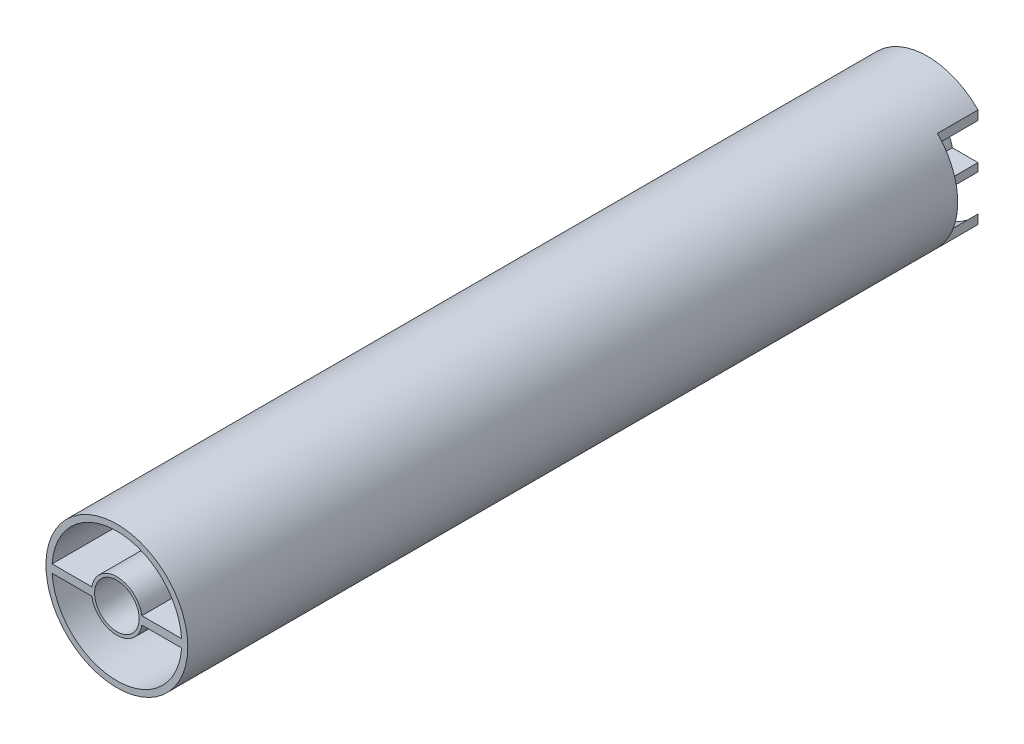
ISO-10303-21;
HEADER;
FILE_DESCRIPTION(('STEP AP214'),'2;1');
FILE_NAME('part.step','',(''),(''),'','','');
FILE_SCHEMA(('AUTOMOTIVE_DESIGN { 1 0 10303 214 1 1 1 1 }'));
ENDSEC;
DATA;
#1=APPLICATION_CONTEXT('core data for automotive mechanical design processes');
#2=APPLICATION_PROTOCOL_DEFINITION('international standard','automotive_design',2000,#1);
#3=PRODUCT_CONTEXT('',#1,'mechanical');
#4=PRODUCT('Part','Part','',(#3));
#5=PRODUCT_RELATED_PRODUCT_CATEGORY('part','',(#4));
#6=PRODUCT_DEFINITION_FORMATION('','',#4);
#7=PRODUCT_DEFINITION_CONTEXT('part definition',#1,'design');
#8=PRODUCT_DEFINITION('design','',#6,#7);
#9=PRODUCT_DEFINITION_SHAPE('','',#8);
#10=(LENGTH_UNIT() NAMED_UNIT(*) SI_UNIT(.MILLI.,.METRE.));
#11=(NAMED_UNIT(*) PLANE_ANGLE_UNIT() SI_UNIT($,.RADIAN.));
#12=(NAMED_UNIT(*) SI_UNIT($,.STERADIAN.) SOLID_ANGLE_UNIT());
#13=UNCERTAINTY_MEASURE_WITH_UNIT(LENGTH_MEASURE(1.E-05),#10,'distance_accuracy_value','');
#14=(GEOMETRIC_REPRESENTATION_CONTEXT(3) GLOBAL_UNCERTAINTY_ASSIGNED_CONTEXT((#13)) GLOBAL_UNIT_ASSIGNED_CONTEXT((#10,
#11,#12)) REPRESENTATION_CONTEXT('',''));
#15=CARTESIAN_POINT('',(0.,0.,0.));
#16=DIRECTION('',(0.,0.,1.));
#17=DIRECTION('',(1.,0.,0.));
#18=AXIS2_PLACEMENT_3D('',#15,#16,#17);
#19=CARTESIAN_POINT('',(0.,0.,200.));
#20=DIRECTION('',(0.,0.,-1.));
#21=DIRECTION('',(-1.,0.,0.));
#22=AXIS2_PLACEMENT_3D('',#19,#20,#21);
#23=CYLINDRICAL_SURFACE('',#22,16.);
#24=DIRECTION('',(0.,0.,-1.));
#25=VECTOR('',#24,1.);
#26=CARTESIAN_POINT('',(-12.5,9.98749217771909,200.));
#27=LINE('',#26,#25);
#28=CARTESIAN_POINT('',(-12.5,9.98749217771909,0.));
#29=VERTEX_POINT('',#28);
#30=CARTESIAN_POINT('',(-12.5,9.98749217771909,10.));
#31=VERTEX_POINT('',#30);
#32=EDGE_CURVE('E309',#29,#31,#27,.F.);
#33=ORIENTED_EDGE('',*,*,#32,.F.);
#34=CARTESIAN_POINT('',(0.,0.,0.));
#35=DIRECTION('',(0.,0.,1.));
#36=DIRECTION('',(1.,0.,0.));
#37=AXIS2_PLACEMENT_3D('',#34,#35,#36);
#38=CIRCLE('',#37,16.);
#39=CARTESIAN_POINT('',(12.5,9.98749217771909,0.));
#40=VERTEX_POINT('',#39);
#41=EDGE_CURVE('E455',#40,#29,#38,.T.);
#42=ORIENTED_EDGE('',*,*,#41,.F.);
#43=DIRECTION('',(0.,0.,-1.));
#44=VECTOR('',#43,1.);
#45=CARTESIAN_POINT('',(12.5,9.98749217771909,200.));
#46=LINE('',#45,#44);
#47=CARTESIAN_POINT('',(12.5,9.98749217771909,10.));
#48=VERTEX_POINT('',#47);
#49=EDGE_CURVE('E71',#40,#48,#46,.F.);
#50=ORIENTED_EDGE('',*,*,#49,.T.);
#51=CARTESIAN_POINT('',(0.,0.,10.));
#52=DIRECTION('',(0.,0.,1.));
#53=DIRECTION('',(1.,0.,0.));
#54=AXIS2_PLACEMENT_3D('',#51,#52,#53);
#55=CIRCLE('',#54,16.);
#56=CARTESIAN_POINT('',(15.9687194226713,0.999999999999998,10.));
#57=VERTEX_POINT('',#56);
#58=EDGE_CURVE('E322',#57,#48,#55,.T.);
#59=ORIENTED_EDGE('',*,*,#58,.F.);
#60=DIRECTION('',(0.,0.,-1.));
#61=VECTOR('',#60,1.);
#62=CARTESIAN_POINT('',(15.9687194226713,0.999999999999998,200.));
#63=LINE('',#62,#61);
#64=CARTESIAN_POINT('',(15.9687194226713,0.999999999999998,147.5));
#65=VERTEX_POINT('',#64);
#66=EDGE_CURVE('E491',#65,#57,#63,.T.);
#67=ORIENTED_EDGE('',*,*,#66,.F.);
#68=CARTESIAN_POINT('',(0.,0.,147.5));
#69=DIRECTION('',(0.,0.,1.));
#70=DIRECTION('',(1.,0.,0.));
#71=AXIS2_PLACEMENT_3D('',#68,#69,#70);
#72=CIRCLE('',#71,16.);
#73=CARTESIAN_POINT('',(-15.9687194226713,1.,147.5));
#74=VERTEX_POINT('',#73);
#75=EDGE_CURVE('E356',#65,#74,#72,.T.);
#76=ORIENTED_EDGE('',*,*,#75,.T.);
#77=DIRECTION('',(0.,0.,-1.));
#78=VECTOR('',#77,1.);
#79=CARTESIAN_POINT('',(-15.9687194226713,1.,200.));
#80=LINE('',#79,#78);
#81=CARTESIAN_POINT('',(-15.9687194226713,1.,10.));
#82=VERTEX_POINT('',#81);
#83=EDGE_CURVE('E482',#74,#82,#80,.T.);
#84=ORIENTED_EDGE('',*,*,#83,.T.);
#85=CARTESIAN_POINT('',(0.,0.,10.));
#86=DIRECTION('',(0.,0.,1.));
#87=DIRECTION('',(1.,0.,0.));
#88=AXIS2_PLACEMENT_3D('',#85,#86,#87);
#89=CIRCLE('',#88,16.);
#90=EDGE_CURVE('E328',#31,#82,#89,.T.);
#91=ORIENTED_EDGE('',*,*,#90,.F.);
#92=EDGE_LOOP('',(#33,#42,#50,#59,#67,#76,#84,#91));
#93=FACE_BOUND('',#92,.T.);
#94=ADVANCED_FACE('F47',(#93),#23,.F.);
#95=CARTESIAN_POINT('',(0.,1.,200.));
#96=DIRECTION('',(0.,1.,0.));
#97=DIRECTION('',(-1.,0.,0.));
#98=AXIS2_PLACEMENT_3D('',#95,#96,#97);
#99=PLANE('',#98);
#100=DIRECTION('',(1.,0.,0.));
#101=VECTOR('',#100,1.);
#102=CARTESIAN_POINT('',(0.,1.,10.));
#103=LINE('',#102,#101);
#104=CARTESIAN_POINT('',(12.5,0.999999999999998,10.));
#105=VERTEX_POINT('',#104);
#106=EDGE_CURVE('E319',#105,#57,#103,.T.);
#107=ORIENTED_EDGE('',*,*,#106,.F.);
#108=DIRECTION('',(0.,0.,-1.));
#109=VECTOR('',#108,1.);
#110=CARTESIAN_POINT('',(12.5,0.999999999999998,200.));
#111=LINE('',#110,#109);
#112=CARTESIAN_POINT('',(12.5,0.999999999999999,0.));
#113=VERTEX_POINT('',#112);
#114=EDGE_CURVE('E293',#105,#113,#111,.T.);
#115=ORIENTED_EDGE('',*,*,#114,.T.);
#116=DIRECTION('',(1.,0.,0.));
#117=VECTOR('',#116,1.);
#118=CARTESIAN_POINT('',(0.,1.,0.));
#119=LINE('',#118,#117);
#120=CARTESIAN_POINT('',(6.16948133962653,0.999999999999999,0.));
#121=VERTEX_POINT('',#120);
#122=EDGE_CURVE('E459',#121,#113,#119,.T.);
#123=ORIENTED_EDGE('',*,*,#122,.F.);
#124=DIRECTION('',(0.,0.,-1.));
#125=VECTOR('',#124,1.);
#126=CARTESIAN_POINT('',(6.16948133962653,0.999999999999999,200.));
#127=LINE('',#126,#125);
#128=CARTESIAN_POINT('',(6.16948133962653,0.999999999999999,147.5));
#129=VERTEX_POINT('',#128);
#130=EDGE_CURVE('E486',#129,#121,#127,.T.);
#131=ORIENTED_EDGE('',*,*,#130,.F.);
#132=DIRECTION('',(1.,0.,0.));
#133=VECTOR('',#132,1.);
#134=CARTESIAN_POINT('',(0.,1.,147.5));
#135=LINE('',#134,#133);
#136=EDGE_CURVE('E382',#129,#65,#135,.T.);
#137=ORIENTED_EDGE('',*,*,#136,.T.);
#138=ORIENTED_EDGE('',*,*,#66,.T.);
#139=EDGE_LOOP('',(#107,#115,#123,#131,#137,#138));
#140=FACE_BOUND('',#139,.T.);
#141=ADVANCED_FACE('F541',(#140),#99,.T.);
#142=CARTESIAN_POINT('',(0.,-1.,200.));
#143=DIRECTION('',(0.,1.,0.));
#144=DIRECTION('',(-1.,0.,0.));
#145=AXIS2_PLACEMENT_3D('',#142,#143,#144);
#146=PLANE('',#145);
#147=DIRECTION('',(0.,0.,-1.));
#148=VECTOR('',#147,1.);
#149=CARTESIAN_POINT('',(12.5,-0.999999999999998,200.));
#150=LINE('',#149,#148);
#151=CARTESIAN_POINT('',(12.5,-0.999999999999998,10.));
#152=VERTEX_POINT('',#151);
#153=CARTESIAN_POINT('',(12.5,-0.999999999999999,0.));
#154=VERTEX_POINT('',#153);
#155=EDGE_CURVE('E290',#152,#154,#150,.T.);
#156=ORIENTED_EDGE('',*,*,#155,.F.);
#157=DIRECTION('',(1.,0.,0.));
#158=VECTOR('',#157,1.);
#159=CARTESIAN_POINT('',(0.,-1.,10.));
#160=LINE('',#159,#158);
#161=CARTESIAN_POINT('',(15.9687194226713,-0.999999999999998,10.));
#162=VERTEX_POINT('',#161);
#163=EDGE_CURVE('E315',#152,#162,#160,.T.);
#164=ORIENTED_EDGE('',*,*,#163,.T.);
#165=DIRECTION('',(0.,0.,-1.));
#166=VECTOR('',#165,1.);
#167=CARTESIAN_POINT('',(15.9687194226713,-0.999999999999998,200.));
#168=LINE('',#167,#166);
#169=CARTESIAN_POINT('',(15.9687194226713,-0.999999999999998,147.5));
#170=VERTEX_POINT('',#169);
#171=EDGE_CURVE('E511',#170,#162,#168,.T.);
#172=ORIENTED_EDGE('',*,*,#171,.F.);
#173=DIRECTION('',(1.,0.,0.));
#174=VECTOR('',#173,1.);
#175=CARTESIAN_POINT('',(0.,-1.,147.5));
#176=LINE('',#175,#174);
#177=CARTESIAN_POINT('',(6.16948133962653,-0.999999999999999,147.5));
#178=VERTEX_POINT('',#177);
#179=EDGE_CURVE('E378',#178,#170,#176,.T.);
#180=ORIENTED_EDGE('',*,*,#179,.F.);
#181=DIRECTION('',(0.,0.,-1.));
#182=VECTOR('',#181,1.);
#183=CARTESIAN_POINT('',(6.16948133962653,-0.999999999999999,200.));
#184=LINE('',#183,#182);
#185=CARTESIAN_POINT('',(6.16948133962653,-0.999999999999999,0.));
#186=VERTEX_POINT('',#185);
#187=EDGE_CURVE('E440',#178,#186,#184,.T.);
#188=ORIENTED_EDGE('',*,*,#187,.T.);
#189=DIRECTION('',(1.,0.,0.));
#190=VECTOR('',#189,1.);
#191=CARTESIAN_POINT('',(0.,-1.,0.));
#192=LINE('',#191,#190);
#193=EDGE_CURVE('E402',#186,#154,#192,.T.);
#194=ORIENTED_EDGE('',*,*,#193,.T.);
#195=EDGE_LOOP('',(#156,#164,#172,#180,#188,#194));
#196=FACE_BOUND('',#195,.T.);
#197=ADVANCED_FACE('F586',(#196),#146,.F.);
#198=CARTESIAN_POINT('',(0.,0.,200.));
#199=DIRECTION('',(0.,0.,-1.));
#200=DIRECTION('',(-1.,0.,0.));
#201=AXIS2_PLACEMENT_3D('',#198,#199,#200);
#202=CYLINDRICAL_SURFACE('',#201,16.);
#203=DIRECTION('',(0.,0.,-1.));
#204=VECTOR('',#203,1.);
#205=CARTESIAN_POINT('',(-12.5,-9.98749217771909,200.));
#206=LINE('',#205,#204);
#207=CARTESIAN_POINT('',(-12.5,-9.98749217771909,10.));
#208=VERTEX_POINT('',#207);
#209=CARTESIAN_POINT('',(-12.5,-9.98749217771909,0.));
#210=VERTEX_POINT('',#209);
#211=EDGE_CURVE('E306',#208,#210,#206,.T.);
#212=ORIENTED_EDGE('',*,*,#211,.F.);
#213=CARTESIAN_POINT('',(0.,0.,10.));
#214=DIRECTION('',(0.,0.,1.));
#215=DIRECTION('',(1.,0.,0.));
#216=AXIS2_PLACEMENT_3D('',#213,#214,#215);
#217=CIRCLE('',#216,16.);
#218=CARTESIAN_POINT('',(-15.9687194226713,-1.,10.));
#219=VERTEX_POINT('',#218);
#220=EDGE_CURVE('E241',#219,#208,#217,.T.);
#221=ORIENTED_EDGE('',*,*,#220,.F.);
#222=DIRECTION('',(0.,0.,-1.));
#223=VECTOR('',#222,1.);
#224=CARTESIAN_POINT('',(-15.9687194226713,-1.,200.));
#225=LINE('',#224,#223);
#226=CARTESIAN_POINT('',(-15.9687194226713,-1.,147.5));
#227=VERTEX_POINT('',#226);
#228=EDGE_CURVE('E506',#227,#219,#225,.T.);
#229=ORIENTED_EDGE('',*,*,#228,.F.);
#230=EDGE_CURVE('E337',#227,#170,#72,.T.);
#231=ORIENTED_EDGE('',*,*,#230,.T.);
#232=ORIENTED_EDGE('',*,*,#171,.T.);
#233=CARTESIAN_POINT('',(0.,0.,10.));
#234=DIRECTION('',(0.,0.,1.));
#235=DIRECTION('',(1.,0.,0.));
#236=AXIS2_PLACEMENT_3D('',#233,#234,#235);
#237=CIRCLE('',#236,16.);
#238=CARTESIAN_POINT('',(12.5,-9.98749217771909,10.));
#239=VERTEX_POINT('',#238);
#240=EDGE_CURVE('E312',#239,#162,#237,.T.);
#241=ORIENTED_EDGE('',*,*,#240,.F.);
#242=DIRECTION('',(0.,0.,-1.));
#243=VECTOR('',#242,1.);
#244=CARTESIAN_POINT('',(12.5,-9.98749217771909,200.));
#245=LINE('',#244,#243);
#246=CARTESIAN_POINT('',(12.5,-9.98749217771909,0.));
#247=VERTEX_POINT('',#246);
#248=EDGE_CURVE('E255',#239,#247,#245,.T.);
#249=ORIENTED_EDGE('',*,*,#248,.T.);
#250=CARTESIAN_POINT('',(0.,0.,0.));
#251=DIRECTION('',(0.,0.,1.));
#252=DIRECTION('',(1.,0.,0.));
#253=AXIS2_PLACEMENT_3D('',#250,#251,#252);
#254=CIRCLE('',#253,16.);
#255=EDGE_CURVE('E444',#210,#247,#254,.T.);
#256=ORIENTED_EDGE('',*,*,#255,.F.);
#257=EDGE_LOOP('',(#212,#221,#229,#231,#232,#241,#249,#256));
#258=FACE_BOUND('',#257,.T.);
#259=ADVANCED_FACE('F580',(#258),#202,.F.);
#260=CARTESIAN_POINT('',(0.,0.,200.));
#261=DIRECTION('',(0.,0.,-1.));
#262=DIRECTION('',(-1.,0.,0.));
#263=AXIS2_PLACEMENT_3D('',#260,#261,#262);
#264=CYLINDRICAL_SURFACE('',#263,17.5);
#265=CARTESIAN_POINT('',(0.,0.,200.));
#266=DIRECTION('',(0.,0.,1.));
#267=DIRECTION('',(1.,0.,0.));
#268=AXIS2_PLACEMENT_3D('',#265,#266,#267);
#269=CIRCLE('',#268,17.5);
#270=CARTESIAN_POINT('',(17.5,0.,200.));
#271=VERTEX_POINT('',#270);
#272=EDGE_CURVE('E432',#271,#271,#269,.T.);
#273=ORIENTED_EDGE('',*,*,#272,.F.);
#274=EDGE_LOOP('',(#273));
#275=FACE_BOUND('',#274,.T.);
#276=CARTESIAN_POINT('',(0.,0.,10.));
#277=DIRECTION('',(0.,0.,1.));
#278=DIRECTION('',(1.,0.,0.));
#279=AXIS2_PLACEMENT_3D('',#276,#277,#278);
#280=CIRCLE('',#279,17.5);
#281=CARTESIAN_POINT('',(-12.5,12.2474487139159,10.));
#282=VERTEX_POINT('',#281);
#283=CARTESIAN_POINT('',(-12.5,-12.2474487139159,10.));
#284=VERTEX_POINT('',#283);
#285=EDGE_CURVE('E239',#282,#284,#280,.T.);
#286=ORIENTED_EDGE('',*,*,#285,.T.);
#287=DIRECTION('',(0.,0.,-1.));
#288=VECTOR('',#287,1.);
#289=CARTESIAN_POINT('',(-12.5,-12.2474487139159,10.));
#290=LINE('',#289,#288);
#291=CARTESIAN_POINT('',(-12.5,-12.2474487139159,0.));
#292=VERTEX_POINT('',#291);
#293=EDGE_CURVE('E249',#284,#292,#290,.T.);
#294=ORIENTED_EDGE('',*,*,#293,.T.);
#295=CARTESIAN_POINT('',(0.,0.,0.));
#296=DIRECTION('',(0.,0.,1.));
#297=DIRECTION('',(1.,0.,0.));
#298=AXIS2_PLACEMENT_3D('',#295,#296,#297);
#299=CIRCLE('',#298,17.5);
#300=CARTESIAN_POINT('',(12.5,-12.2474487139159,0.));
#301=VERTEX_POINT('',#300);
#302=EDGE_CURVE('E470',#292,#301,#299,.T.);
#303=ORIENTED_EDGE('',*,*,#302,.T.);
#304=DIRECTION('',(0.,0.,-1.));
#305=VECTOR('',#304,1.);
#306=CARTESIAN_POINT('',(12.5,-12.2474487139159,10.));
#307=LINE('',#306,#305);
#308=CARTESIAN_POINT('',(12.5,-12.2474487139159,10.));
#309=VERTEX_POINT('',#308);
#310=EDGE_CURVE('E263',#309,#301,#307,.T.);
#311=ORIENTED_EDGE('',*,*,#310,.F.);
#312=CARTESIAN_POINT('',(0.,0.,10.));
#313=DIRECTION('',(0.,0.,1.));
#314=DIRECTION('',(1.,0.,0.));
#315=AXIS2_PLACEMENT_3D('',#312,#313,#314);
#316=CIRCLE('',#315,17.5);
#317=CARTESIAN_POINT('',(12.5,12.2474487139159,10.));
#318=VERTEX_POINT('',#317);
#319=EDGE_CURVE('E272',#309,#318,#316,.T.);
#320=ORIENTED_EDGE('',*,*,#319,.T.);
#321=DIRECTION('',(0.,0.,-1.));
#322=VECTOR('',#321,1.);
#323=CARTESIAN_POINT('',(12.5,12.2474487139159,10.));
#324=LINE('',#323,#322);
#325=CARTESIAN_POINT('',(12.5,12.2474487139159,0.));
#326=VERTEX_POINT('',#325);
#327=EDGE_CURVE('E278',#318,#326,#324,.T.);
#328=ORIENTED_EDGE('',*,*,#327,.T.);
#329=CARTESIAN_POINT('',(-12.5,12.2474487139159,0.));
#330=VERTEX_POINT('',#329);
#331=EDGE_CURVE('E471',#326,#330,#299,.T.);
#332=ORIENTED_EDGE('',*,*,#331,.T.);
#333=DIRECTION('',(0.,0.,-1.));
#334=VECTOR('',#333,1.);
#335=CARTESIAN_POINT('',(-12.5,12.2474487139159,10.));
#336=LINE('',#335,#334);
#337=EDGE_CURVE('E63',#282,#330,#336,.T.);
#338=ORIENTED_EDGE('',*,*,#337,.F.);
#339=EDGE_LOOP('',(#286,#294,#303,#311,#320,#328,#332,#338));
#340=FACE_BOUND('',#339,.T.);
#341=ADVANCED_FACE('F257',(#275,#340),#264,.T.);
#342=CARTESIAN_POINT('',(0.,0.,0.));
#343=DIRECTION('',(0.,0.,1.));
#344=DIRECTION('',(1.,0.,0.));
#345=AXIS2_PLACEMENT_3D('',#342,#343,#344);
#346=PLANE('',#345);
#347=ORIENTED_EDGE('',*,*,#302,.F.);
#348=DIRECTION('',(0.,1.,0.));
#349=VECTOR('',#348,1.);
#350=CARTESIAN_POINT('',(-12.5,0.,0.));
#351=LINE('',#350,#349);
#352=EDGE_CURVE('E11',#292,#210,#351,.T.);
#353=ORIENTED_EDGE('',*,*,#352,.T.);
#354=ORIENTED_EDGE('',*,*,#255,.T.);
#355=DIRECTION('',(0.,1.,0.));
#356=VECTOR('',#355,1.);
#357=CARTESIAN_POINT('',(12.5,0.,0.));
#358=LINE('',#357,#356);
#359=EDGE_CURVE('E523',#301,#247,#358,.T.);
#360=ORIENTED_EDGE('',*,*,#359,.F.);
#361=EDGE_LOOP('',(#347,#353,#354,#360));
#362=FACE_BOUND('',#361,.T.);
#363=ADVANCED_FACE('F640',(#362),#346,.F.);
#364=CARTESIAN_POINT('',(0.,0.,0.));
#365=DIRECTION('',(0.,0.,1.));
#366=DIRECTION('',(1.,0.,0.));
#367=AXIS2_PLACEMENT_3D('',#364,#365,#366);
#368=CIRCLE('',#367,5.5);
#369=CARTESIAN_POINT('',(5.5,0.,0.));
#370=VERTEX_POINT('',#369);
#371=EDGE_CURVE('E407',#370,#370,#368,.T.);
#372=ORIENTED_EDGE('',*,*,#371,.T.);
#373=EDGE_LOOP('',(#372));
#374=FACE_BOUND('',#373,.T.);
#375=DIRECTION('',(1.,0.,0.));
#376=VECTOR('',#375,1.);
#377=CARTESIAN_POINT('',(0.,-0.999999999999999,0.));
#378=LINE('',#377,#376);
#379=CARTESIAN_POINT('',(-12.5,-1.,0.));
#380=VERTEX_POINT('',#379);
#381=CARTESIAN_POINT('',(-6.16948133962653,-0.999999999999999,0.));
#382=VERTEX_POINT('',#381);
#383=EDGE_CURVE('E448',#380,#382,#378,.T.);
#384=ORIENTED_EDGE('',*,*,#383,.F.);
#385=CARTESIAN_POINT('',(-12.5,1.,0.));
#386=VERTEX_POINT('',#385);
#387=EDGE_CURVE('E56',#380,#386,#351,.T.);
#388=ORIENTED_EDGE('',*,*,#387,.T.);
#389=DIRECTION('',(1.,0.,0.));
#390=VECTOR('',#389,1.);
#391=CARTESIAN_POINT('',(0.,0.999999999999999,0.));
#392=LINE('',#391,#390);
#393=CARTESIAN_POINT('',(-6.16948133962653,0.999999999999999,0.));
#394=VERTEX_POINT('',#393);
#395=EDGE_CURVE('E467',#386,#394,#392,.T.);
#396=ORIENTED_EDGE('',*,*,#395,.T.);
#397=CARTESIAN_POINT('',(0.,0.,0.));
#398=DIRECTION('',(0.,0.,1.));
#399=DIRECTION('',(1.,0.,0.));
#400=AXIS2_PLACEMENT_3D('',#397,#398,#399);
#401=CIRCLE('',#400,6.25);
#402=EDGE_CURVE('E463',#121,#394,#401,.T.);
#403=ORIENTED_EDGE('',*,*,#402,.F.);
#404=ORIENTED_EDGE('',*,*,#122,.T.);
#405=EDGE_CURVE('E522',#154,#113,#358,.T.);
#406=ORIENTED_EDGE('',*,*,#405,.F.);
#407=ORIENTED_EDGE('',*,*,#193,.F.);
#408=CARTESIAN_POINT('',(0.,0.,0.));
#409=DIRECTION('',(0.,0.,1.));
#410=DIRECTION('',(1.,0.,0.));
#411=AXIS2_PLACEMENT_3D('',#408,#409,#410);
#412=CIRCLE('',#411,6.25);
#413=EDGE_CURVE('E451',#382,#186,#412,.T.);
#414=ORIENTED_EDGE('',*,*,#413,.F.);
#415=EDGE_LOOP('',(#384,#388,#396,#403,#404,#406,#407,#414));
#416=FACE_BOUND('',#415,.T.);
#417=ADVANCED_FACE('F546',(#374,#416),#346,.F.);
#418=ORIENTED_EDGE('',*,*,#41,.T.);
#419=DIRECTION('',(0.,-1.,0.));
#420=VECTOR('',#419,1.);
#421=CARTESIAN_POINT('',(-12.5,0.,0.));
#422=LINE('',#421,#420);
#423=EDGE_CURVE('E260',#330,#29,#422,.T.);
#424=ORIENTED_EDGE('',*,*,#423,.F.);
#425=ORIENTED_EDGE('',*,*,#331,.F.);
#426=DIRECTION('',(0.,-1.,0.));
#427=VECTOR('',#426,1.);
#428=CARTESIAN_POINT('',(12.5,0.,0.));
#429=LINE('',#428,#427);
#430=EDGE_CURVE('E279',#326,#40,#429,.T.);
#431=ORIENTED_EDGE('',*,*,#430,.T.);
#432=EDGE_LOOP('',(#418,#424,#425,#431));
#433=FACE_BOUND('',#432,.T.);
#434=ADVANCED_FACE('F649',(#433),#346,.F.);
#435=CARTESIAN_POINT('',(0.,0.,200.));
#436=DIRECTION('',(0.,0.,-1.));
#437=DIRECTION('',(-1.,0.,0.));
#438=AXIS2_PLACEMENT_3D('',#435,#436,#437);
#439=CYLINDRICAL_SURFACE('',#438,6.25);
#440=CARTESIAN_POINT('',(0.,0.,147.5));
#441=DIRECTION('',(0.,0.,1.));
#442=DIRECTION('',(1.,0.,0.));
#443=AXIS2_PLACEMENT_3D('',#440,#441,#442);
#444=CIRCLE('',#443,6.25);
#445=CARTESIAN_POINT('',(-6.16948133962653,0.999999999999999,147.5));
#446=VERTEX_POINT('',#445);
#447=EDGE_CURVE('E360',#129,#446,#444,.T.);
#448=ORIENTED_EDGE('',*,*,#447,.F.);
#449=ORIENTED_EDGE('',*,*,#130,.T.);
#450=ORIENTED_EDGE('',*,*,#402,.T.);
#451=DIRECTION('',(0.,0.,-1.));
#452=VECTOR('',#451,1.);
#453=CARTESIAN_POINT('',(-6.16948133962653,0.999999999999999,200.));
#454=LINE('',#453,#452);
#455=EDGE_CURVE('E481',#446,#394,#454,.T.);
#456=ORIENTED_EDGE('',*,*,#455,.F.);
#457=EDGE_LOOP('',(#448,#449,#450,#456));
#458=FACE_BOUND('',#457,.T.);
#459=ADVANCED_FACE('F552',(#458),#439,.T.);
#460=CARTESIAN_POINT('',(0.,-0.999999999999999,200.));
#461=DIRECTION('',(0.,1.,0.));
#462=DIRECTION('',(-1.,0.,0.));
#463=AXIS2_PLACEMENT_3D('',#460,#461,#462);
#464=PLANE('',#463);
#465=DIRECTION('',(1.,0.,0.));
#466=VECTOR('',#465,1.);
#467=CARTESIAN_POINT('',(0.,-0.999999999999999,10.));
#468=LINE('',#467,#466);
#469=CARTESIAN_POINT('',(-12.5,-1.,10.));
#470=VERTEX_POINT('',#469);
#471=EDGE_CURVE('E331',#219,#470,#468,.T.);
#472=ORIENTED_EDGE('',*,*,#471,.T.);
#473=DIRECTION('',(0.,0.,-1.));
#474=VECTOR('',#473,1.);
#475=CARTESIAN_POINT('',(-12.5,-1.,200.));
#476=LINE('',#475,#474);
#477=EDGE_CURVE('E302',#470,#380,#476,.T.);
#478=ORIENTED_EDGE('',*,*,#477,.T.);
#479=ORIENTED_EDGE('',*,*,#383,.T.);
#480=DIRECTION('',(0.,0.,-1.));
#481=VECTOR('',#480,1.);
#482=CARTESIAN_POINT('',(-6.16948133962653,-0.999999999999999,200.));
#483=LINE('',#482,#481);
#484=CARTESIAN_POINT('',(-6.16948133962653,-0.999999999999999,147.5));
#485=VERTEX_POINT('',#484);
#486=EDGE_CURVE('E501',#485,#382,#483,.T.);
#487=ORIENTED_EDGE('',*,*,#486,.F.);
#488=DIRECTION('',(1.,0.,0.));
#489=VECTOR('',#488,1.);
#490=CARTESIAN_POINT('',(0.,-0.999999999999999,147.5));
#491=LINE('',#490,#489);
#492=EDGE_CURVE('E374',#227,#485,#491,.T.);
#493=ORIENTED_EDGE('',*,*,#492,.F.);
#494=ORIENTED_EDGE('',*,*,#228,.T.);
#495=EDGE_LOOP('',(#472,#478,#479,#487,#493,#494));
#496=FACE_BOUND('',#495,.T.);
#497=ADVANCED_FACE('F575',(#496),#464,.F.);
#498=CARTESIAN_POINT('',(0.,0.999999999999999,200.));
#499=DIRECTION('',(0.,1.,0.));
#500=DIRECTION('',(-1.,0.,0.));
#501=AXIS2_PLACEMENT_3D('',#498,#499,#500);
#502=PLANE('',#501);
#503=DIRECTION('',(0.,0.,-1.));
#504=VECTOR('',#503,1.);
#505=CARTESIAN_POINT('',(-12.5,1.,200.));
#506=LINE('',#505,#504);
#507=CARTESIAN_POINT('',(-12.5,1.,10.));
#508=VERTEX_POINT('',#507);
#509=EDGE_CURVE('E299',#508,#386,#506,.T.);
#510=ORIENTED_EDGE('',*,*,#509,.F.);
#511=DIRECTION('',(1.,0.,0.));
#512=VECTOR('',#511,1.);
#513=CARTESIAN_POINT('',(0.,0.999999999999999,10.));
#514=LINE('',#513,#512);
#515=EDGE_CURVE('E325',#82,#508,#514,.T.);
#516=ORIENTED_EDGE('',*,*,#515,.F.);
#517=ORIENTED_EDGE('',*,*,#83,.F.);
#518=DIRECTION('',(1.,0.,0.));
#519=VECTOR('',#518,1.);
#520=CARTESIAN_POINT('',(0.,0.999999999999999,147.5));
#521=LINE('',#520,#519);
#522=EDGE_CURVE('E355',#74,#446,#521,.T.);
#523=ORIENTED_EDGE('',*,*,#522,.T.);
#524=ORIENTED_EDGE('',*,*,#455,.T.);
#525=ORIENTED_EDGE('',*,*,#395,.F.);
#526=EDGE_LOOP('',(#510,#516,#517,#523,#524,#525));
#527=FACE_BOUND('',#526,.T.);
#528=ADVANCED_FACE('F602',(#527),#502,.T.);
#529=CARTESIAN_POINT('',(0.,0.,200.));
#530=DIRECTION('',(0.,0.,-1.));
#531=DIRECTION('',(-1.,0.,0.));
#532=AXIS2_PLACEMENT_3D('',#529,#530,#531);
#533=CYLINDRICAL_SURFACE('',#532,6.25);
#534=CARTESIAN_POINT('',(0.,0.,147.5));
#535=DIRECTION('',(0.,0.,1.));
#536=DIRECTION('',(1.,0.,0.));
#537=AXIS2_PLACEMENT_3D('',#534,#535,#536);
#538=CIRCLE('',#537,6.25);
#539=EDGE_CURVE('E496',#485,#178,#538,.T.);
#540=ORIENTED_EDGE('',*,*,#539,.F.);
#541=ORIENTED_EDGE('',*,*,#486,.T.);
#542=ORIENTED_EDGE('',*,*,#413,.T.);
#543=ORIENTED_EDGE('',*,*,#187,.F.);
#544=EDGE_LOOP('',(#540,#541,#542,#543));
#545=FACE_BOUND('',#544,.T.);
#546=ADVANCED_FACE('F599',(#545),#533,.T.);
#547=CARTESIAN_POINT('',(0.,0.,152.5));
#548=DIRECTION('',(0.,0.,1.));
#549=DIRECTION('',(1.,0.,0.));
#550=AXIS2_PLACEMENT_3D('',#547,#548,#549);
#551=CIRCLE('',#550,16.);
#552=CARTESIAN_POINT('',(15.9687194226713,0.999999999999998,152.5));
#553=VERTEX_POINT('',#552);
#554=CARTESIAN_POINT('',(-15.9687194226713,1.,152.5));
#555=VERTEX_POINT('',#554);
#556=EDGE_CURVE('E338',#553,#555,#551,.T.);
#557=ORIENTED_EDGE('',*,*,#556,.F.);
#558=CARTESIAN_POINT('',(15.9687194226713,0.999999999999998,200.));
#559=VERTEX_POINT('',#558);
#560=EDGE_CURVE('E492',#559,#553,#63,.T.);
#561=ORIENTED_EDGE('',*,*,#560,.F.);
#562=CARTESIAN_POINT('',(0.,0.,200.));
#563=DIRECTION('',(0.,0.,1.));
#564=DIRECTION('',(1.,0.,0.));
#565=AXIS2_PLACEMENT_3D('',#562,#563,#564);
#566=CIRCLE('',#565,16.);
#567=CARTESIAN_POINT('',(-15.9687194226713,1.,200.));
#568=VERTEX_POINT('',#567);
#569=EDGE_CURVE('E417',#559,#568,#566,.T.);
#570=ORIENTED_EDGE('',*,*,#569,.T.);
#571=EDGE_CURVE('E477',#568,#555,#80,.T.);
#572=ORIENTED_EDGE('',*,*,#571,.T.);
#573=EDGE_LOOP('',(#557,#561,#570,#572));
#574=FACE_BOUND('',#573,.T.);
#575=ADVANCED_FACE('F601',(#574),#23,.F.);
#576=DIRECTION('',(1.,0.,0.));
#577=VECTOR('',#576,1.);
#578=CARTESIAN_POINT('',(0.,1.,152.5));
#579=LINE('',#578,#577);
#580=CARTESIAN_POINT('',(6.16948133962653,0.999999999999999,152.5));
#581=VERTEX_POINT('',#580);
#582=EDGE_CURVE('E398',#581,#553,#579,.T.);
#583=ORIENTED_EDGE('',*,*,#582,.F.);
#584=CARTESIAN_POINT('',(6.16948133962653,0.999999999999999,200.));
#585=VERTEX_POINT('',#584);
#586=EDGE_CURVE('E487',#585,#581,#127,.T.);
#587=ORIENTED_EDGE('',*,*,#586,.F.);
#588=DIRECTION('',(1.,0.,0.));
#589=VECTOR('',#588,1.);
#590=CARTESIAN_POINT('',(0.,1.,200.));
#591=LINE('',#590,#589);
#592=EDGE_CURVE('E421',#585,#559,#591,.T.);
#593=ORIENTED_EDGE('',*,*,#592,.T.);
#594=ORIENTED_EDGE('',*,*,#560,.T.);
#595=EDGE_LOOP('',(#583,#587,#593,#594));
#596=FACE_BOUND('',#595,.T.);
#597=ADVANCED_FACE('F609',(#596),#99,.T.);
#598=ORIENTED_EDGE('',*,*,#586,.T.);
#599=CARTESIAN_POINT('',(0.,0.,152.5));
#600=DIRECTION('',(0.,0.,1.));
#601=DIRECTION('',(1.,0.,0.));
#602=AXIS2_PLACEMENT_3D('',#599,#600,#601);
#603=CIRCLE('',#602,6.25);
#604=CARTESIAN_POINT('',(-6.16948133962653,0.999999999999999,152.5));
#605=VERTEX_POINT('',#604);
#606=EDGE_CURVE('E342',#581,#605,#603,.T.);
#607=ORIENTED_EDGE('',*,*,#606,.T.);
#608=CARTESIAN_POINT('',(-6.16948133962653,0.999999999999999,200.));
#609=VERTEX_POINT('',#608);
#610=EDGE_CURVE('E483',#609,#605,#454,.T.);
#611=ORIENTED_EDGE('',*,*,#610,.F.);
#612=CARTESIAN_POINT('',(0.,0.,200.));
#613=DIRECTION('',(0.,0.,1.));
#614=DIRECTION('',(1.,0.,0.));
#615=AXIS2_PLACEMENT_3D('',#612,#613,#614);
#616=CIRCLE('',#615,6.25);
#617=EDGE_CURVE('E425',#585,#609,#616,.T.);
#618=ORIENTED_EDGE('',*,*,#617,.F.);
#619=EDGE_LOOP('',(#598,#607,#611,#618));
#620=FACE_BOUND('',#619,.T.);
#621=ADVANCED_FACE('F630',(#620),#439,.T.);
#622=CARTESIAN_POINT('',(6.16948133962653,-0.999999999999999,200.));
#623=VERTEX_POINT('',#622);
#624=CARTESIAN_POINT('',(6.16948133962653,-0.999999999999999,152.5));
#625=VERTEX_POINT('',#624);
#626=EDGE_CURVE('E497',#623,#625,#184,.T.);
#627=ORIENTED_EDGE('',*,*,#626,.T.);
#628=DIRECTION('',(1.,0.,0.));
#629=VECTOR('',#628,1.);
#630=CARTESIAN_POINT('',(0.,-1.,152.5));
#631=LINE('',#630,#629);
#632=CARTESIAN_POINT('',(15.9687194226713,-0.999999999999998,152.5));
#633=VERTEX_POINT('',#632);
#634=EDGE_CURVE('E394',#625,#633,#631,.T.);
#635=ORIENTED_EDGE('',*,*,#634,.T.);
#636=CARTESIAN_POINT('',(15.9687194226713,-0.999999999999998,200.));
#637=VERTEX_POINT('',#636);
#638=EDGE_CURVE('E512',#637,#633,#168,.T.);
#639=ORIENTED_EDGE('',*,*,#638,.F.);
#640=DIRECTION('',(1.,0.,0.));
#641=VECTOR('',#640,1.);
#642=CARTESIAN_POINT('',(0.,-1.,200.));
#643=LINE('',#642,#641);
#644=EDGE_CURVE('E403',#623,#637,#643,.T.);
#645=ORIENTED_EDGE('',*,*,#644,.F.);
#646=EDGE_LOOP('',(#627,#635,#639,#645));
#647=FACE_BOUND('',#646,.T.);
#648=ADVANCED_FACE('F49',(#647),#146,.F.);
#649=CARTESIAN_POINT('',(-15.9687194226713,-1.,152.5));
#650=VERTEX_POINT('',#649);
#651=EDGE_CURVE('E343',#650,#633,#551,.T.);
#652=ORIENTED_EDGE('',*,*,#651,.F.);
#653=CARTESIAN_POINT('',(-15.9687194226713,-1.,200.));
#654=VERTEX_POINT('',#653);
#655=EDGE_CURVE('E507',#654,#650,#225,.T.);
#656=ORIENTED_EDGE('',*,*,#655,.F.);
#657=CARTESIAN_POINT('',(0.,0.,200.));
#658=DIRECTION('',(0.,0.,1.));
#659=DIRECTION('',(1.,0.,0.));
#660=AXIS2_PLACEMENT_3D('',#657,#658,#659);
#661=CIRCLE('',#660,16.);
#662=EDGE_CURVE('E406',#654,#637,#661,.T.);
#663=ORIENTED_EDGE('',*,*,#662,.T.);
#664=ORIENTED_EDGE('',*,*,#638,.T.);
#665=EDGE_LOOP('',(#652,#656,#663,#664));
#666=FACE_BOUND('',#665,.T.);
#667=ADVANCED_FACE('F764',(#666),#202,.F.);
#668=ORIENTED_EDGE('',*,*,#655,.T.);
#669=DIRECTION('',(1.,0.,0.));
#670=VECTOR('',#669,1.);
#671=CARTESIAN_POINT('',(0.,-0.999999999999999,152.5));
#672=LINE('',#671,#670);
#673=CARTESIAN_POINT('',(-6.16948133962653,-0.999999999999999,152.5));
#674=VERTEX_POINT('',#673);
#675=EDGE_CURVE('E390',#650,#674,#672,.T.);
#676=ORIENTED_EDGE('',*,*,#675,.T.);
#677=CARTESIAN_POINT('',(-6.16948133962653,-0.999999999999999,200.));
#678=VERTEX_POINT('',#677);
#679=EDGE_CURVE('E502',#678,#674,#483,.T.);
#680=ORIENTED_EDGE('',*,*,#679,.F.);
#681=DIRECTION('',(1.,0.,0.));
#682=VECTOR('',#681,1.);
#683=CARTESIAN_POINT('',(0.,-0.999999999999999,200.));
#684=LINE('',#683,#682);
#685=EDGE_CURVE('E411',#654,#678,#684,.T.);
#686=ORIENTED_EDGE('',*,*,#685,.F.);
#687=EDGE_LOOP('',(#668,#676,#680,#686));
#688=FACE_BOUND('',#687,.T.);
#689=ADVANCED_FACE('F636',(#688),#464,.F.);
#690=DIRECTION('',(1.,0.,0.));
#691=VECTOR('',#690,1.);
#692=CARTESIAN_POINT('',(0.,0.999999999999999,152.5));
#693=LINE('',#692,#691);
#694=EDGE_CURVE('E386',#555,#605,#693,.T.);
#695=ORIENTED_EDGE('',*,*,#694,.F.);
#696=ORIENTED_EDGE('',*,*,#571,.F.);
#697=DIRECTION('',(1.,0.,0.));
#698=VECTOR('',#697,1.);
#699=CARTESIAN_POINT('',(0.,0.999999999999999,200.));
#700=LINE('',#699,#698);
#701=EDGE_CURVE('E428',#568,#609,#700,.T.);
#702=ORIENTED_EDGE('',*,*,#701,.T.);
#703=ORIENTED_EDGE('',*,*,#610,.T.);
#704=EDGE_LOOP('',(#695,#696,#702,#703));
#705=FACE_BOUND('',#704,.T.);
#706=ADVANCED_FACE('F615',(#705),#502,.T.);
#707=ORIENTED_EDGE('',*,*,#679,.T.);
#708=CARTESIAN_POINT('',(0.,0.,152.5));
#709=DIRECTION('',(0.,0.,1.));
#710=DIRECTION('',(1.,0.,0.));
#711=AXIS2_PLACEMENT_3D('',#708,#709,#710);
#712=CIRCLE('',#711,6.25);
#713=EDGE_CURVE('E519',#674,#625,#712,.T.);
#714=ORIENTED_EDGE('',*,*,#713,.T.);
#715=ORIENTED_EDGE('',*,*,#626,.F.);
#716=CARTESIAN_POINT('',(0.,0.,200.));
#717=DIRECTION('',(0.,0.,1.));
#718=DIRECTION('',(1.,0.,0.));
#719=AXIS2_PLACEMENT_3D('',#716,#717,#718);
#720=CIRCLE('',#719,6.25);
#721=EDGE_CURVE('E414',#678,#623,#720,.T.);
#722=ORIENTED_EDGE('',*,*,#721,.F.);
#723=EDGE_LOOP('',(#707,#714,#715,#722));
#724=FACE_BOUND('',#723,.T.);
#725=ADVANCED_FACE('F604',(#724),#533,.T.);
#726=CARTESIAN_POINT('',(0.,0.,200.));
#727=DIRECTION('',(0.,0.,-1.));
#728=DIRECTION('',(-1.,0.,0.));
#729=AXIS2_PLACEMENT_3D('',#726,#727,#728);
#730=CYLINDRICAL_SURFACE('',#729,5.5);
#731=CARTESIAN_POINT('',(0.,0.,200.));
#732=DIRECTION('',(0.,0.,1.));
#733=DIRECTION('',(1.,0.,0.));
#734=AXIS2_PLACEMENT_3D('',#731,#732,#733);
#735=CIRCLE('',#734,5.5);
#736=CARTESIAN_POINT('',(5.5,0.,200.));
#737=VERTEX_POINT('',#736);
#738=EDGE_CURVE('E436',#737,#737,#735,.T.);
#739=ORIENTED_EDGE('',*,*,#738,.T.);
#740=EDGE_LOOP('',(#739));
#741=FACE_BOUND('',#740,.T.);
#742=ORIENTED_EDGE('',*,*,#371,.F.);
#743=EDGE_LOOP('',(#742));
#744=FACE_BOUND('',#743,.T.);
#745=ADVANCED_FACE('F618',(#741,#744),#730,.F.);
#746=CARTESIAN_POINT('',(0.,0.,200.));
#747=DIRECTION('',(0.,0.,1.));
#748=DIRECTION('',(1.,0.,0.));
#749=AXIS2_PLACEMENT_3D('',#746,#747,#748);
#750=PLANE('',#749);
#751=ORIENTED_EDGE('',*,*,#644,.T.);
#752=ORIENTED_EDGE('',*,*,#662,.F.);
#753=ORIENTED_EDGE('',*,*,#685,.T.);
#754=ORIENTED_EDGE('',*,*,#721,.T.);
#755=EDGE_LOOP('',(#751,#752,#753,#754));
#756=FACE_BOUND('',#755,.T.);
#757=ORIENTED_EDGE('',*,*,#569,.F.);
#758=ORIENTED_EDGE('',*,*,#592,.F.);
#759=ORIENTED_EDGE('',*,*,#617,.T.);
#760=ORIENTED_EDGE('',*,*,#701,.F.);
#761=EDGE_LOOP('',(#757,#758,#759,#760));
#762=FACE_BOUND('',#761,.T.);
#763=ORIENTED_EDGE('',*,*,#272,.T.);
#764=EDGE_LOOP('',(#763));
#765=FACE_BOUND('',#764,.T.);
#766=ORIENTED_EDGE('',*,*,#738,.F.);
#767=EDGE_LOOP('',(#766));
#768=FACE_BOUND('',#767,.T.);
#769=ADVANCED_FACE('F644',(#756,#762,#765,#768),#750,.T.);
#770=CARTESIAN_POINT('',(0.,0.,152.5));
#771=DIRECTION('',(0.,0.,1.));
#772=DIRECTION('',(1.,0.,0.));
#773=AXIS2_PLACEMENT_3D('',#770,#771,#772);
#774=PLANE('',#773);
#775=CARTESIAN_POINT('',(0.,-11.125,152.5));
#776=DIRECTION('',(0.,0.,1.));
#777=DIRECTION('',(1.,0.,0.));
#778=AXIS2_PLACEMENT_3D('',#775,#776,#777);
#779=CIRCLE('',#778,4.);
#780=CARTESIAN_POINT('',(4.,-11.125,152.5));
#781=VERTEX_POINT('',#780);
#782=EDGE_CURVE('E351',#781,#781,#779,.F.);
#783=ORIENTED_EDGE('',*,*,#782,.T.);
#784=EDGE_LOOP('',(#783));
#785=FACE_BOUND('',#784,.T.);
#786=ORIENTED_EDGE('',*,*,#634,.F.);
#787=ORIENTED_EDGE('',*,*,#713,.F.);
#788=ORIENTED_EDGE('',*,*,#675,.F.);
#789=ORIENTED_EDGE('',*,*,#651,.T.);
#790=EDGE_LOOP('',(#786,#787,#788,#789));
#791=FACE_BOUND('',#790,.T.);
#792=ADVANCED_FACE('F652',(#785,#791),#774,.T.);
#793=CARTESIAN_POINT('',(0.,-11.125,152.5));
#794=DIRECTION('',(0.,0.,-1.));
#795=DIRECTION('',(-1.,0.,0.));
#796=AXIS2_PLACEMENT_3D('',#793,#794,#795);
#797=CYLINDRICAL_SURFACE('',#796,4.);
#798=ORIENTED_EDGE('',*,*,#782,.F.);
#799=EDGE_LOOP('',(#798));
#800=FACE_BOUND('',#799,.T.);
#801=CARTESIAN_POINT('',(0.,-11.125,147.5));
#802=DIRECTION('',(0.,0.,1.));
#803=DIRECTION('',(1.,0.,0.));
#804=AXIS2_PLACEMENT_3D('',#801,#802,#803);
#805=CIRCLE('',#804,4.);
#806=CARTESIAN_POINT('',(4.,-11.125,147.5));
#807=VERTEX_POINT('',#806);
#808=EDGE_CURVE('E367',#807,#807,#805,.F.);
#809=ORIENTED_EDGE('',*,*,#808,.T.);
#810=EDGE_LOOP('',(#809));
#811=FACE_BOUND('',#810,.T.);
#812=ADVANCED_FACE('F658',(#800,#811),#797,.F.);
#813=CARTESIAN_POINT('',(0.,0.,147.5));
#814=DIRECTION('',(0.,0.,1.));
#815=DIRECTION('',(1.,0.,0.));
#816=AXIS2_PLACEMENT_3D('',#813,#814,#815);
#817=PLANE('',#816);
#818=ORIENTED_EDGE('',*,*,#808,.F.);
#819=EDGE_LOOP('',(#818));
#820=FACE_BOUND('',#819,.T.);
#821=ORIENTED_EDGE('',*,*,#539,.T.);
#822=ORIENTED_EDGE('',*,*,#179,.T.);
#823=ORIENTED_EDGE('',*,*,#230,.F.);
#824=ORIENTED_EDGE('',*,*,#492,.T.);
#825=EDGE_LOOP('',(#821,#822,#823,#824));
#826=FACE_BOUND('',#825,.T.);
#827=ADVANCED_FACE('F583',(#820,#826),#817,.F.);
#828=CARTESIAN_POINT('',(0.,11.125,152.5));
#829=DIRECTION('',(0.,0.,1.));
#830=DIRECTION('',(1.,0.,0.));
#831=AXIS2_PLACEMENT_3D('',#828,#829,#830);
#832=CIRCLE('',#831,4.);
#833=CARTESIAN_POINT('',(4.,11.125,152.5));
#834=VERTEX_POINT('',#833);
#835=EDGE_CURVE('E347',#834,#834,#832,.T.);
#836=ORIENTED_EDGE('',*,*,#835,.F.);
#837=EDGE_LOOP('',(#836));
#838=FACE_BOUND('',#837,.T.);
#839=ORIENTED_EDGE('',*,*,#606,.F.);
#840=ORIENTED_EDGE('',*,*,#582,.T.);
#841=ORIENTED_EDGE('',*,*,#556,.T.);
#842=ORIENTED_EDGE('',*,*,#694,.T.);
#843=EDGE_LOOP('',(#839,#840,#841,#842));
#844=FACE_BOUND('',#843,.T.);
#845=ADVANCED_FACE('F664',(#838,#844),#774,.T.);
#846=ORIENTED_EDGE('',*,*,#136,.F.);
#847=ORIENTED_EDGE('',*,*,#447,.T.);
#848=ORIENTED_EDGE('',*,*,#522,.F.);
#849=ORIENTED_EDGE('',*,*,#75,.F.);
#850=EDGE_LOOP('',(#846,#847,#848,#849));
#851=FACE_BOUND('',#850,.T.);
#852=CARTESIAN_POINT('',(0.,11.125,147.5));
#853=DIRECTION('',(0.,0.,1.));
#854=DIRECTION('',(1.,0.,0.));
#855=AXIS2_PLACEMENT_3D('',#852,#853,#854);
#856=CIRCLE('',#855,4.);
#857=CARTESIAN_POINT('',(4.,11.125,147.5));
#858=VERTEX_POINT('',#857);
#859=EDGE_CURVE('E363',#858,#858,#856,.T.);
#860=ORIENTED_EDGE('',*,*,#859,.T.);
#861=EDGE_LOOP('',(#860));
#862=FACE_BOUND('',#861,.T.);
#863=ADVANCED_FACE('F656',(#851,#862),#817,.F.);
#864=CARTESIAN_POINT('',(0.,11.125,152.5));
#865=DIRECTION('',(0.,0.,-1.));
#866=DIRECTION('',(-1.,0.,0.));
#867=AXIS2_PLACEMENT_3D('',#864,#865,#866);
#868=CYLINDRICAL_SURFACE('',#867,4.);
#869=ORIENTED_EDGE('',*,*,#835,.T.);
#870=EDGE_LOOP('',(#869));
#871=FACE_BOUND('',#870,.T.);
#872=ORIENTED_EDGE('',*,*,#859,.F.);
#873=EDGE_LOOP('',(#872));
#874=FACE_BOUND('',#873,.T.);
#875=ADVANCED_FACE('F654',(#871,#874),#868,.F.);
#876=CARTESIAN_POINT('',(0.,0.,10.));
#877=DIRECTION('',(0.,0.,1.));
#878=DIRECTION('',(1.,0.,0.));
#879=AXIS2_PLACEMENT_3D('',#876,#877,#878);
#880=PLANE('',#879);
#881=ORIENTED_EDGE('',*,*,#58,.T.);
#882=DIRECTION('',(0.,-1.,0.));
#883=VECTOR('',#882,1.);
#884=CARTESIAN_POINT('',(12.5,0.,10.));
#885=LINE('',#884,#883);
#886=EDGE_CURVE('E269',#318,#48,#885,.T.);
#887=ORIENTED_EDGE('',*,*,#886,.F.);
#888=ORIENTED_EDGE('',*,*,#319,.F.);
#889=EDGE_CURVE('E274',#239,#309,#885,.T.);
#890=ORIENTED_EDGE('',*,*,#889,.F.);
#891=ORIENTED_EDGE('',*,*,#240,.T.);
#892=ORIENTED_EDGE('',*,*,#163,.F.);
#893=EDGE_CURVE('E273',#105,#152,#885,.T.);
#894=ORIENTED_EDGE('',*,*,#893,.F.);
#895=ORIENTED_EDGE('',*,*,#106,.T.);
#896=EDGE_LOOP('',(#881,#887,#888,#890,#891,#892,#894,#895));
#897=FACE_BOUND('',#896,.T.);
#898=ADVANCED_FACE('F591',(#897),#880,.F.);
#899=CARTESIAN_POINT('',(12.5,0.,10.));
#900=DIRECTION('',(1.,0.,0.));
#901=DIRECTION('',(0.,0.,-1.));
#902=AXIS2_PLACEMENT_3D('',#899,#900,#901);
#903=PLANE('',#902);
#904=ORIENTED_EDGE('',*,*,#430,.F.);
#905=ORIENTED_EDGE('',*,*,#327,.F.);
#906=ORIENTED_EDGE('',*,*,#886,.T.);
#907=ORIENTED_EDGE('',*,*,#49,.F.);
#908=EDGE_LOOP('',(#904,#905,#906,#907));
#909=FACE_BOUND('',#908,.T.);
#910=ADVANCED_FACE('F673',(#909),#903,.T.);
#911=ORIENTED_EDGE('',*,*,#893,.T.);
#912=ORIENTED_EDGE('',*,*,#155,.T.);
#913=ORIENTED_EDGE('',*,*,#405,.T.);
#914=ORIENTED_EDGE('',*,*,#114,.F.);
#915=EDGE_LOOP('',(#911,#912,#913,#914));
#916=FACE_BOUND('',#915,.T.);
#917=ADVANCED_FACE('F533',(#916),#903,.T.);
#918=ORIENTED_EDGE('',*,*,#889,.T.);
#919=ORIENTED_EDGE('',*,*,#310,.T.);
#920=ORIENTED_EDGE('',*,*,#359,.T.);
#921=ORIENTED_EDGE('',*,*,#248,.F.);
#922=EDGE_LOOP('',(#918,#919,#920,#921));
#923=FACE_BOUND('',#922,.T.);
#924=ADVANCED_FACE('F669',(#923),#903,.T.);
#925=CARTESIAN_POINT('',(-12.5,0.,10.));
#926=DIRECTION('',(1.,0.,0.));
#927=DIRECTION('',(0.,0.,-1.));
#928=AXIS2_PLACEMENT_3D('',#925,#926,#927);
#929=PLANE('',#928);
#930=DIRECTION('',(0.,-1.,0.));
#931=VECTOR('',#930,1.);
#932=CARTESIAN_POINT('',(-12.5,0.,10.));
#933=LINE('',#932,#931);
#934=EDGE_CURVE('E245',#508,#470,#933,.T.);
#935=ORIENTED_EDGE('',*,*,#934,.F.);
#936=ORIENTED_EDGE('',*,*,#509,.T.);
#937=ORIENTED_EDGE('',*,*,#387,.F.);
#938=ORIENTED_EDGE('',*,*,#477,.F.);
#939=EDGE_LOOP('',(#935,#936,#937,#938));
#940=FACE_BOUND('',#939,.T.);
#941=ADVANCED_FACE('F672',(#940),#929,.F.);
#942=ORIENTED_EDGE('',*,*,#32,.T.);
#943=EDGE_CURVE('E247',#282,#31,#933,.T.);
#944=ORIENTED_EDGE('',*,*,#943,.F.);
#945=ORIENTED_EDGE('',*,*,#337,.T.);
#946=ORIENTED_EDGE('',*,*,#423,.T.);
#947=EDGE_LOOP('',(#942,#944,#945,#946));
#948=FACE_BOUND('',#947,.T.);
#949=ADVANCED_FACE('F678',(#948),#929,.F.);
#950=ORIENTED_EDGE('',*,*,#211,.T.);
#951=ORIENTED_EDGE('',*,*,#352,.F.);
#952=ORIENTED_EDGE('',*,*,#293,.F.);
#953=EDGE_CURVE('E234',#208,#284,#933,.T.);
#954=ORIENTED_EDGE('',*,*,#953,.F.);
#955=EDGE_LOOP('',(#950,#951,#952,#954));
#956=FACE_BOUND('',#955,.T.);
#957=ADVANCED_FACE('F250',(#956),#929,.F.);
#958=CARTESIAN_POINT('',(0.,0.,10.));
#959=DIRECTION('',(0.,0.,1.));
#960=DIRECTION('',(1.,0.,0.));
#961=AXIS2_PLACEMENT_3D('',#958,#959,#960);
#962=PLANE('',#961);
#963=ORIENTED_EDGE('',*,*,#220,.T.);
#964=ORIENTED_EDGE('',*,*,#953,.T.);
#965=ORIENTED_EDGE('',*,*,#285,.F.);
#966=ORIENTED_EDGE('',*,*,#943,.T.);
#967=ORIENTED_EDGE('',*,*,#90,.T.);
#968=ORIENTED_EDGE('',*,*,#515,.T.);
#969=ORIENTED_EDGE('',*,*,#934,.T.);
#970=ORIENTED_EDGE('',*,*,#471,.F.);
#971=EDGE_LOOP('',(#963,#964,#965,#966,#967,#968,#969,#970));
#972=FACE_BOUND('',#971,.T.);
#973=ADVANCED_FACE('F236',(#972),#962,.F.);
#974=CLOSED_SHELL('',(#94,#141,#197,#259,#341,#363,#417,#434,#459,#497,#528,#546,#575,#597,#621,
#648,#667,#689,#706,#725,#745,#769,#792,#812,#827,#845,#863,#875,#898,#910,#917,#924,#941,#949,
#957,#973));
#975=MANIFOLD_SOLID_BREP('B2',#974);
#976=ADVANCED_BREP_SHAPE_REPRESENTATION('',(#18,#975),#14);
#977=SHAPE_DEFINITION_REPRESENTATION(#9,#976);
ENDSEC;
END-ISO-10303-21;
